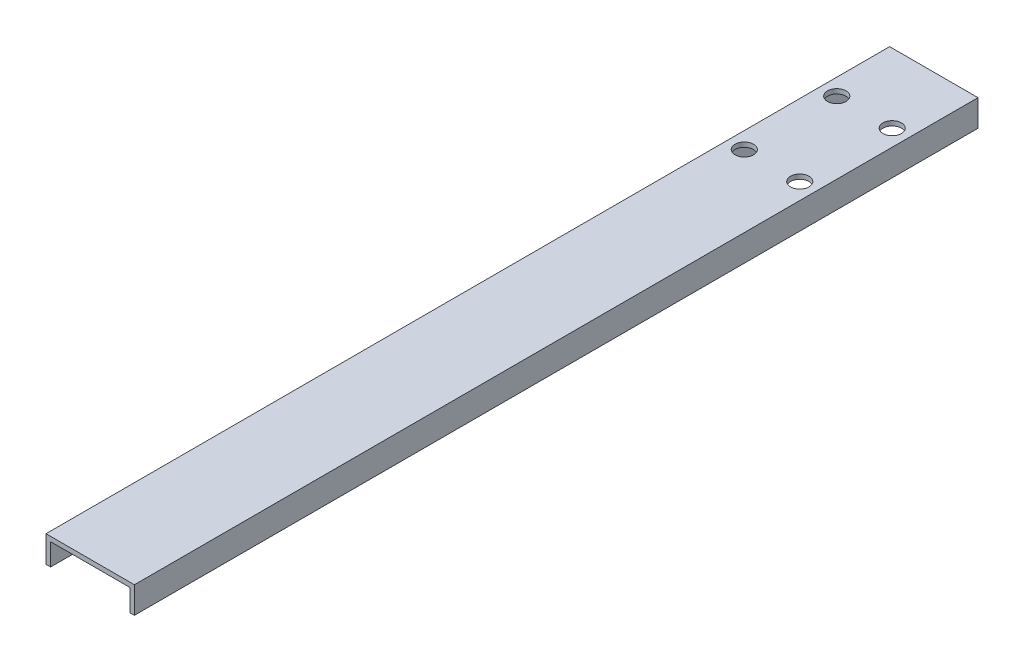
ISO-10303-21;
HEADER;
FILE_DESCRIPTION(('STEP AP214'),'2;1');
FILE_NAME('part.step','',(''),(''),'','','');
FILE_SCHEMA(('AUTOMOTIVE_DESIGN { 1 0 10303 214 1 1 1 1 }'));
ENDSEC;
DATA;
#1=APPLICATION_CONTEXT('core data for automotive mechanical design processes');
#2=APPLICATION_PROTOCOL_DEFINITION('international standard','automotive_design',2000,#1);
#3=PRODUCT_CONTEXT('',#1,'mechanical');
#4=PRODUCT('Part','Part','',(#3));
#5=PRODUCT_RELATED_PRODUCT_CATEGORY('part','',(#4));
#6=PRODUCT_DEFINITION_FORMATION('','',#4);
#7=PRODUCT_DEFINITION_CONTEXT('part definition',#1,'design');
#8=PRODUCT_DEFINITION('design','',#6,#7);
#9=PRODUCT_DEFINITION_SHAPE('','',#8);
#10=(LENGTH_UNIT() NAMED_UNIT(*) SI_UNIT(.MILLI.,.METRE.));
#11=(NAMED_UNIT(*) PLANE_ANGLE_UNIT() SI_UNIT($,.RADIAN.));
#12=(NAMED_UNIT(*) SI_UNIT($,.STERADIAN.) SOLID_ANGLE_UNIT());
#13=UNCERTAINTY_MEASURE_WITH_UNIT(LENGTH_MEASURE(1.E-05),#10,'distance_accuracy_value','');
#14=(GEOMETRIC_REPRESENTATION_CONTEXT(3) GLOBAL_UNCERTAINTY_ASSIGNED_CONTEXT((#13)) GLOBAL_UNIT_ASSIGNED_CONTEXT((#10,
#11,#12)) REPRESENTATION_CONTEXT('',''));
#15=CARTESIAN_POINT('',(0.,0.,0.));
#16=DIRECTION('',(0.,0.,1.));
#17=DIRECTION('',(1.,0.,0.));
#18=AXIS2_PLACEMENT_3D('',#15,#16,#17);
#19=CARTESIAN_POINT('',(1.27,0.,231.775));
#20=DIRECTION('',(0.,1.,0.));
#21=DIRECTION('',(-1.,0.,0.));
#22=AXIS2_PLACEMENT_3D('',#19,#20,#21);
#23=PLANE('',#22);
#24=DIRECTION('',(1.,0.,0.));
#25=VECTOR('',#24,1.);
#26=CARTESIAN_POINT('',(1.27,0.,0.));
#27=LINE('',#26,#25);
#28=CARTESIAN_POINT('',(0.,0.,0.));
#29=VERTEX_POINT('',#28);
#30=CARTESIAN_POINT('',(1.27,0.,0.));
#31=VERTEX_POINT('',#30);
#32=EDGE_CURVE('E130',#29,#31,#27,.T.);
#33=ORIENTED_EDGE('',*,*,#32,.T.);
#34=DIRECTION('',(0.,0.,-1.));
#35=VECTOR('',#34,1.);
#36=CARTESIAN_POINT('',(1.27,0.,231.775));
#37=LINE('',#36,#35);
#38=CARTESIAN_POINT('',(1.27,0.,231.775));
#39=VERTEX_POINT('',#38);
#40=EDGE_CURVE('E11',#39,#31,#37,.T.);
#41=ORIENTED_EDGE('',*,*,#40,.F.);
#42=DIRECTION('',(1.,0.,0.));
#43=VECTOR('',#42,1.);
#44=CARTESIAN_POINT('',(1.27,0.,231.775));
#45=LINE('',#44,#43);
#46=CARTESIAN_POINT('',(0.,0.,231.775));
#47=VERTEX_POINT('',#46);
#48=EDGE_CURVE('E145',#47,#39,#45,.T.);
#49=ORIENTED_EDGE('',*,*,#48,.F.);
#50=DIRECTION('',(0.,0.,-1.));
#51=VECTOR('',#50,1.);
#52=CARTESIAN_POINT('',(0.,0.,231.775));
#53=LINE('',#52,#51);
#54=EDGE_CURVE('E126',#47,#29,#53,.T.);
#55=ORIENTED_EDGE('',*,*,#54,.T.);
#56=EDGE_LOOP('',(#33,#41,#49,#55));
#57=FACE_BOUND('',#56,.T.);
#58=ADVANCED_FACE('F34',(#57),#23,.F.);
#59=CARTESIAN_POINT('',(1.27,6.0198,231.775));
#60=DIRECTION('',(-1.,0.,0.));
#61=DIRECTION('',(0.,0.,1.));
#62=AXIS2_PLACEMENT_3D('',#59,#60,#61);
#63=PLANE('',#62);
#64=DIRECTION('',(0.,1.,0.));
#65=VECTOR('',#64,1.);
#66=CARTESIAN_POINT('',(1.27,6.0198,0.));
#67=LINE('',#66,#65);
#68=CARTESIAN_POINT('',(1.27,6.0198,0.));
#69=VERTEX_POINT('',#68);
#70=EDGE_CURVE('E133',#31,#69,#67,.T.);
#71=ORIENTED_EDGE('',*,*,#70,.T.);
#72=DIRECTION('',(0.,0.,-1.));
#73=VECTOR('',#72,1.);
#74=CARTESIAN_POINT('',(1.27,6.0198,231.775));
#75=LINE('',#74,#73);
#76=CARTESIAN_POINT('',(1.27,6.0198,231.775));
#77=VERTEX_POINT('',#76);
#78=EDGE_CURVE('E42',#77,#69,#75,.T.);
#79=ORIENTED_EDGE('',*,*,#78,.F.);
#80=DIRECTION('',(0.,1.,0.));
#81=VECTOR('',#80,1.);
#82=CARTESIAN_POINT('',(1.27,6.0198,231.775));
#83=LINE('',#82,#81);
#84=EDGE_CURVE('E93',#39,#77,#83,.T.);
#85=ORIENTED_EDGE('',*,*,#84,.F.);
#86=ORIENTED_EDGE('',*,*,#40,.T.);
#87=EDGE_LOOP('',(#71,#79,#85,#86));
#88=FACE_BOUND('',#87,.T.);
#89=ADVANCED_FACE('F223',(#88),#63,.F.);
#90=CARTESIAN_POINT('',(23.0124,6.0198,231.775));
#91=DIRECTION('',(0.,1.,0.));
#92=DIRECTION('',(-1.,0.,0.));
#93=AXIS2_PLACEMENT_3D('',#90,#91,#92);
#94=PLANE('',#93);
#95=CARTESIAN_POINT('',(4.5212,6.0198,44.45));
#96=DIRECTION('',(0.,1.,0.));
#97=DIRECTION('',(-1.,0.,0.));
#98=AXIS2_PLACEMENT_3D('',#95,#96,#97);
#99=CIRCLE('',#98,2.54);
#100=CARTESIAN_POINT('',(1.9812,6.0198,44.45));
#101=VERTEX_POINT('',#100);
#102=EDGE_CURVE('E195',#101,#101,#99,.T.);
#103=ORIENTED_EDGE('',*,*,#102,.T.);
#104=EDGE_LOOP('',(#103));
#105=FACE_BOUND('',#104,.T.);
#106=CARTESIAN_POINT('',(19.7612,6.0198,44.45));
#107=DIRECTION('',(0.,1.,0.));
#108=DIRECTION('',(-1.,0.,0.));
#109=AXIS2_PLACEMENT_3D('',#106,#107,#108);
#110=CIRCLE('',#109,2.54);
#111=CARTESIAN_POINT('',(17.2212,6.0198,44.45));
#112=VERTEX_POINT('',#111);
#113=EDGE_CURVE('E189',#112,#112,#110,.T.);
#114=ORIENTED_EDGE('',*,*,#113,.T.);
#115=EDGE_LOOP('',(#114));
#116=FACE_BOUND('',#115,.T.);
#117=CARTESIAN_POINT('',(19.7612,6.0198,19.05));
#118=DIRECTION('',(0.,1.,0.));
#119=DIRECTION('',(-1.,0.,0.));
#120=AXIS2_PLACEMENT_3D('',#117,#118,#119);
#121=CIRCLE('',#120,2.54);
#122=CARTESIAN_POINT('',(17.2212,6.0198,19.05));
#123=VERTEX_POINT('',#122);
#124=EDGE_CURVE('E183',#123,#123,#121,.T.);
#125=ORIENTED_EDGE('',*,*,#124,.T.);
#126=EDGE_LOOP('',(#125));
#127=FACE_BOUND('',#126,.T.);
#128=CARTESIAN_POINT('',(4.5212,6.0198,19.05));
#129=DIRECTION('',(0.,1.,0.));
#130=DIRECTION('',(-1.,0.,0.));
#131=AXIS2_PLACEMENT_3D('',#128,#129,#130);
#132=CIRCLE('',#131,2.54);
#133=CARTESIAN_POINT('',(1.98119999999999,6.0198,19.05));
#134=VERTEX_POINT('',#133);
#135=EDGE_CURVE('E134',#134,#134,#132,.T.);
#136=ORIENTED_EDGE('',*,*,#135,.T.);
#137=EDGE_LOOP('',(#136));
#138=FACE_BOUND('',#137,.T.);
#139=DIRECTION('',(1.,0.,0.));
#140=VECTOR('',#139,1.);
#141=CARTESIAN_POINT('',(23.0124,6.0198,0.));
#142=LINE('',#141,#140);
#143=CARTESIAN_POINT('',(23.0124,6.0198,0.));
#144=VERTEX_POINT('',#143);
#145=EDGE_CURVE('E136',#69,#144,#142,.T.);
#146=ORIENTED_EDGE('',*,*,#145,.T.);
#147=DIRECTION('',(0.,0.,-1.));
#148=VECTOR('',#147,1.);
#149=CARTESIAN_POINT('',(23.0124,6.0198,231.775));
#150=LINE('',#149,#148);
#151=CARTESIAN_POINT('',(23.0124,6.0198,231.775));
#152=VERTEX_POINT('',#151);
#153=EDGE_CURVE('E152',#152,#144,#150,.T.);
#154=ORIENTED_EDGE('',*,*,#153,.F.);
#155=DIRECTION('',(1.,0.,0.));
#156=VECTOR('',#155,1.);
#157=CARTESIAN_POINT('',(23.0124,6.0198,231.775));
#158=LINE('',#157,#156);
#159=EDGE_CURVE('E160',#77,#152,#158,.T.);
#160=ORIENTED_EDGE('',*,*,#159,.F.);
#161=ORIENTED_EDGE('',*,*,#78,.T.);
#162=EDGE_LOOP('',(#146,#154,#160,#161));
#163=FACE_BOUND('',#162,.T.);
#164=ADVANCED_FACE('F158',(#105,#116,#127,#138,#163),#94,.F.);
#165=CARTESIAN_POINT('',(23.0124,0.,231.775));
#166=DIRECTION('',(1.,0.,0.));
#167=DIRECTION('',(0.,1.,0.));
#168=AXIS2_PLACEMENT_3D('',#165,#166,#167);
#169=PLANE('',#168);
#170=DIRECTION('',(0.,-1.,0.));
#171=VECTOR('',#170,1.);
#172=CARTESIAN_POINT('',(23.0124,0.,0.));
#173=LINE('',#172,#171);
#174=CARTESIAN_POINT('',(23.0124,0.,0.));
#175=VERTEX_POINT('',#174);
#176=EDGE_CURVE('E138',#144,#175,#173,.T.);
#177=ORIENTED_EDGE('',*,*,#176,.T.);
#178=DIRECTION('',(0.,0.,-1.));
#179=VECTOR('',#178,1.);
#180=CARTESIAN_POINT('',(23.0124,0.,231.775));
#181=LINE('',#180,#179);
#182=CARTESIAN_POINT('',(23.0124,0.,231.775));
#183=VERTEX_POINT('',#182);
#184=EDGE_CURVE('E149',#183,#175,#181,.T.);
#185=ORIENTED_EDGE('',*,*,#184,.F.);
#186=DIRECTION('',(0.,-1.,0.));
#187=VECTOR('',#186,1.);
#188=CARTESIAN_POINT('',(23.0124,0.,231.775));
#189=LINE('',#188,#187);
#190=EDGE_CURVE('E172',#152,#183,#189,.T.);
#191=ORIENTED_EDGE('',*,*,#190,.F.);
#192=ORIENTED_EDGE('',*,*,#153,.T.);
#193=EDGE_LOOP('',(#177,#185,#191,#192));
#194=FACE_BOUND('',#193,.T.);
#195=ADVANCED_FACE('F168',(#194),#169,.F.);
#196=CARTESIAN_POINT('',(24.2824,0.,231.775));
#197=DIRECTION('',(0.,1.,0.));
#198=DIRECTION('',(-1.,0.,0.));
#199=AXIS2_PLACEMENT_3D('',#196,#197,#198);
#200=PLANE('',#199);
#201=DIRECTION('',(1.,0.,0.));
#202=VECTOR('',#201,1.);
#203=CARTESIAN_POINT('',(24.2824,0.,0.));
#204=LINE('',#203,#202);
#205=CARTESIAN_POINT('',(24.2824,0.,0.));
#206=VERTEX_POINT('',#205);
#207=EDGE_CURVE('E140',#175,#206,#204,.T.);
#208=ORIENTED_EDGE('',*,*,#207,.T.);
#209=DIRECTION('',(0.,0.,-1.));
#210=VECTOR('',#209,1.);
#211=CARTESIAN_POINT('',(24.2824,0.,231.775));
#212=LINE('',#211,#210);
#213=CARTESIAN_POINT('',(24.2824,0.,231.775));
#214=VERTEX_POINT('',#213);
#215=EDGE_CURVE('E121',#214,#206,#212,.T.);
#216=ORIENTED_EDGE('',*,*,#215,.F.);
#217=DIRECTION('',(1.,0.,0.));
#218=VECTOR('',#217,1.);
#219=CARTESIAN_POINT('',(24.2824,0.,231.775));
#220=LINE('',#219,#218);
#221=EDGE_CURVE('E112',#183,#214,#220,.T.);
#222=ORIENTED_EDGE('',*,*,#221,.F.);
#223=ORIENTED_EDGE('',*,*,#184,.T.);
#224=EDGE_LOOP('',(#208,#216,#222,#223));
#225=FACE_BOUND('',#224,.T.);
#226=ADVANCED_FACE('F171',(#225),#200,.F.);
#227=CARTESIAN_POINT('',(24.2824,7.2898,231.775));
#228=DIRECTION('',(-1.,0.,0.));
#229=DIRECTION('',(0.,-1.,0.));
#230=AXIS2_PLACEMENT_3D('',#227,#228,#229);
#231=PLANE('',#230);
#232=DIRECTION('',(0.,1.,0.));
#233=VECTOR('',#232,1.);
#234=CARTESIAN_POINT('',(24.2824,7.2898,0.));
#235=LINE('',#234,#233);
#236=CARTESIAN_POINT('',(24.2824,7.2898,0.));
#237=VERTEX_POINT('',#236);
#238=EDGE_CURVE('E120',#206,#237,#235,.T.);
#239=ORIENTED_EDGE('',*,*,#238,.T.);
#240=DIRECTION('',(0.,0.,-1.));
#241=VECTOR('',#240,1.);
#242=CARTESIAN_POINT('',(24.2824,7.2898,231.775));
#243=LINE('',#242,#241);
#244=CARTESIAN_POINT('',(24.2824,7.2898,231.775));
#245=VERTEX_POINT('',#244);
#246=EDGE_CURVE('E117',#245,#237,#243,.T.);
#247=ORIENTED_EDGE('',*,*,#246,.F.);
#248=DIRECTION('',(0.,1.,0.));
#249=VECTOR('',#248,1.);
#250=CARTESIAN_POINT('',(24.2824,7.2898,231.775));
#251=LINE('',#250,#249);
#252=EDGE_CURVE('E106',#214,#245,#251,.T.);
#253=ORIENTED_EDGE('',*,*,#252,.F.);
#254=ORIENTED_EDGE('',*,*,#215,.T.);
#255=EDGE_LOOP('',(#239,#247,#253,#254));
#256=FACE_BOUND('',#255,.T.);
#257=ADVANCED_FACE('F118',(#256),#231,.F.);
#258=CARTESIAN_POINT('',(0.,7.2898,231.775));
#259=DIRECTION('',(0.,-1.,0.));
#260=DIRECTION('',(1.,0.,0.));
#261=AXIS2_PLACEMENT_3D('',#258,#259,#260);
#262=PLANE('',#261);
#263=CARTESIAN_POINT('',(4.5212,7.2898,44.45));
#264=DIRECTION('',(0.,1.,0.));
#265=DIRECTION('',(-1.,0.,0.));
#266=AXIS2_PLACEMENT_3D('',#263,#264,#265);
#267=CIRCLE('',#266,2.54);
#268=CARTESIAN_POINT('',(1.9812,7.2898,44.45));
#269=VERTEX_POINT('',#268);
#270=EDGE_CURVE('E198',#269,#269,#267,.T.);
#271=ORIENTED_EDGE('',*,*,#270,.F.);
#272=EDGE_LOOP('',(#271));
#273=FACE_BOUND('',#272,.T.);
#274=CARTESIAN_POINT('',(19.7612,7.2898,44.45));
#275=DIRECTION('',(0.,1.,0.));
#276=DIRECTION('',(-1.,0.,0.));
#277=AXIS2_PLACEMENT_3D('',#274,#275,#276);
#278=CIRCLE('',#277,2.54);
#279=CARTESIAN_POINT('',(17.2212,7.2898,44.45));
#280=VERTEX_POINT('',#279);
#281=EDGE_CURVE('E192',#280,#280,#278,.T.);
#282=ORIENTED_EDGE('',*,*,#281,.F.);
#283=EDGE_LOOP('',(#282));
#284=FACE_BOUND('',#283,.T.);
#285=CARTESIAN_POINT('',(19.7612,7.2898,19.05));
#286=DIRECTION('',(0.,1.,0.));
#287=DIRECTION('',(-1.,0.,0.));
#288=AXIS2_PLACEMENT_3D('',#285,#286,#287);
#289=CIRCLE('',#288,2.54);
#290=CARTESIAN_POINT('',(17.2212,7.2898,19.05));
#291=VERTEX_POINT('',#290);
#292=EDGE_CURVE('E186',#291,#291,#289,.T.);
#293=ORIENTED_EDGE('',*,*,#292,.F.);
#294=EDGE_LOOP('',(#293));
#295=FACE_BOUND('',#294,.T.);
#296=CARTESIAN_POINT('',(4.5212,7.2898,19.05));
#297=DIRECTION('',(0.,1.,0.));
#298=DIRECTION('',(-1.,0.,0.));
#299=AXIS2_PLACEMENT_3D('',#296,#297,#298);
#300=CIRCLE('',#299,2.54);
#301=CARTESIAN_POINT('',(1.98119999999999,7.2898,19.05));
#302=VERTEX_POINT('',#301);
#303=EDGE_CURVE('E180',#302,#302,#300,.T.);
#304=ORIENTED_EDGE('',*,*,#303,.F.);
#305=EDGE_LOOP('',(#304));
#306=FACE_BOUND('',#305,.T.);
#307=DIRECTION('',(-1.,0.,0.));
#308=VECTOR('',#307,1.);
#309=CARTESIAN_POINT('',(0.,7.2898,0.));
#310=LINE('',#309,#308);
#311=CARTESIAN_POINT('',(0.,7.2898,0.));
#312=VERTEX_POINT('',#311);
#313=EDGE_CURVE('E79',#237,#312,#310,.T.);
#314=ORIENTED_EDGE('',*,*,#313,.T.);
#315=DIRECTION('',(0.,0.,-1.));
#316=VECTOR('',#315,1.);
#317=CARTESIAN_POINT('',(0.,7.2898,231.775));
#318=LINE('',#317,#316);
#319=CARTESIAN_POINT('',(0.,7.2898,231.775));
#320=VERTEX_POINT('',#319);
#321=EDGE_CURVE('E122',#320,#312,#318,.T.);
#322=ORIENTED_EDGE('',*,*,#321,.F.);
#323=DIRECTION('',(-1.,0.,0.));
#324=VECTOR('',#323,1.);
#325=CARTESIAN_POINT('',(0.,7.2898,231.775));
#326=LINE('',#325,#324);
#327=EDGE_CURVE('E110',#245,#320,#326,.T.);
#328=ORIENTED_EDGE('',*,*,#327,.F.);
#329=ORIENTED_EDGE('',*,*,#246,.T.);
#330=EDGE_LOOP('',(#314,#322,#328,#329));
#331=FACE_BOUND('',#330,.T.);
#332=ADVANCED_FACE('F124',(#273,#284,#295,#306,#331),#262,.F.);
#333=CARTESIAN_POINT('',(0.,0.,231.775));
#334=DIRECTION('',(1.,0.,0.));
#335=DIRECTION('',(0.,1.,0.));
#336=AXIS2_PLACEMENT_3D('',#333,#334,#335);
#337=PLANE('',#336);
#338=DIRECTION('',(0.,-1.,0.));
#339=VECTOR('',#338,1.);
#340=CARTESIAN_POINT('',(0.,0.,0.));
#341=LINE('',#340,#339);
#342=EDGE_CURVE('E85',#312,#29,#341,.T.);
#343=ORIENTED_EDGE('',*,*,#342,.T.);
#344=ORIENTED_EDGE('',*,*,#54,.F.);
#345=DIRECTION('',(0.,-1.,0.));
#346=VECTOR('',#345,1.);
#347=CARTESIAN_POINT('',(0.,0.,231.775));
#348=LINE('',#347,#346);
#349=EDGE_CURVE('E50',#320,#47,#348,.T.);
#350=ORIENTED_EDGE('',*,*,#349,.F.);
#351=ORIENTED_EDGE('',*,*,#321,.T.);
#352=EDGE_LOOP('',(#343,#344,#350,#351));
#353=FACE_BOUND('',#352,.T.);
#354=ADVANCED_FACE('F207',(#353),#337,.F.);
#355=CARTESIAN_POINT('',(0.,0.,231.775));
#356=DIRECTION('',(0.,0.,-1.));
#357=DIRECTION('',(-1.,0.,0.));
#358=AXIS2_PLACEMENT_3D('',#355,#356,#357);
#359=PLANE('',#358);
#360=ORIENTED_EDGE('',*,*,#48,.T.);
#361=ORIENTED_EDGE('',*,*,#84,.T.);
#362=ORIENTED_EDGE('',*,*,#159,.T.);
#363=ORIENTED_EDGE('',*,*,#190,.T.);
#364=ORIENTED_EDGE('',*,*,#221,.T.);
#365=ORIENTED_EDGE('',*,*,#252,.T.);
#366=ORIENTED_EDGE('',*,*,#327,.T.);
#367=ORIENTED_EDGE('',*,*,#349,.T.);
#368=EDGE_LOOP('',(#360,#361,#362,#363,#364,#365,#366,#367));
#369=FACE_BOUND('',#368,.T.);
#370=ADVANCED_FACE('F108',(#369),#359,.F.);
#371=CARTESIAN_POINT('',(0.,0.,0.));
#372=DIRECTION('',(0.,0.,-1.));
#373=DIRECTION('',(-1.,0.,0.));
#374=AXIS2_PLACEMENT_3D('',#371,#372,#373);
#375=PLANE('',#374);
#376=ORIENTED_EDGE('',*,*,#32,.F.);
#377=ORIENTED_EDGE('',*,*,#342,.F.);
#378=ORIENTED_EDGE('',*,*,#313,.F.);
#379=ORIENTED_EDGE('',*,*,#238,.F.);
#380=ORIENTED_EDGE('',*,*,#207,.F.);
#381=ORIENTED_EDGE('',*,*,#176,.F.);
#382=ORIENTED_EDGE('',*,*,#145,.F.);
#383=ORIENTED_EDGE('',*,*,#70,.F.);
#384=EDGE_LOOP('',(#376,#377,#378,#379,#380,#381,#382,#383));
#385=FACE_BOUND('',#384,.T.);
#386=ADVANCED_FACE('F164',(#385),#375,.T.);
#387=CARTESIAN_POINT('',(4.5212,0.,19.05));
#388=DIRECTION('',(0.,1.,0.));
#389=DIRECTION('',(-1.,0.,0.));
#390=AXIS2_PLACEMENT_3D('',#387,#388,#389);
#391=CYLINDRICAL_SURFACE('',#390,2.54);
#392=ORIENTED_EDGE('',*,*,#303,.T.);
#393=EDGE_LOOP('',(#392));
#394=FACE_BOUND('',#393,.T.);
#395=ORIENTED_EDGE('',*,*,#135,.F.);
#396=EDGE_LOOP('',(#395));
#397=FACE_BOUND('',#396,.T.);
#398=ADVANCED_FACE('F215',(#394,#397),#391,.F.);
#399=CARTESIAN_POINT('',(19.7612,0.,19.05));
#400=DIRECTION('',(0.,1.,0.));
#401=DIRECTION('',(-1.,0.,0.));
#402=AXIS2_PLACEMENT_3D('',#399,#400,#401);
#403=CYLINDRICAL_SURFACE('',#402,2.54);
#404=ORIENTED_EDGE('',*,*,#292,.T.);
#405=EDGE_LOOP('',(#404));
#406=FACE_BOUND('',#405,.T.);
#407=ORIENTED_EDGE('',*,*,#124,.F.);
#408=EDGE_LOOP('',(#407));
#409=FACE_BOUND('',#408,.T.);
#410=ADVANCED_FACE('F218',(#406,#409),#403,.F.);
#411=CARTESIAN_POINT('',(19.7612,0.,44.45));
#412=DIRECTION('',(0.,1.,0.));
#413=DIRECTION('',(-1.,0.,0.));
#414=AXIS2_PLACEMENT_3D('',#411,#412,#413);
#415=CYLINDRICAL_SURFACE('',#414,2.54);
#416=ORIENTED_EDGE('',*,*,#281,.T.);
#417=EDGE_LOOP('',(#416));
#418=FACE_BOUND('',#417,.T.);
#419=ORIENTED_EDGE('',*,*,#113,.F.);
#420=EDGE_LOOP('',(#419));
#421=FACE_BOUND('',#420,.T.);
#422=ADVANCED_FACE('F280',(#418,#421),#415,.F.);
#423=CARTESIAN_POINT('',(4.5212,0.,44.45));
#424=DIRECTION('',(0.,1.,0.));
#425=DIRECTION('',(-1.,0.,0.));
#426=AXIS2_PLACEMENT_3D('',#423,#424,#425);
#427=CYLINDRICAL_SURFACE('',#426,2.54);
#428=ORIENTED_EDGE('',*,*,#270,.T.);
#429=EDGE_LOOP('',(#428));
#430=FACE_BOUND('',#429,.T.);
#431=ORIENTED_EDGE('',*,*,#102,.F.);
#432=EDGE_LOOP('',(#431));
#433=FACE_BOUND('',#432,.T.);
#434=ADVANCED_FACE('F202',(#430,#433),#427,.F.);
#435=CLOSED_SHELL('',(#58,#89,#164,#195,#226,#257,#332,#354,#370,#386,#398,#410,#422,#434));
#436=MANIFOLD_SOLID_BREP('B2',#435);
#437=ADVANCED_BREP_SHAPE_REPRESENTATION('',(#18,#436),#14);
#438=SHAPE_DEFINITION_REPRESENTATION(#9,#437);
ENDSEC;
END-ISO-10303-21;
